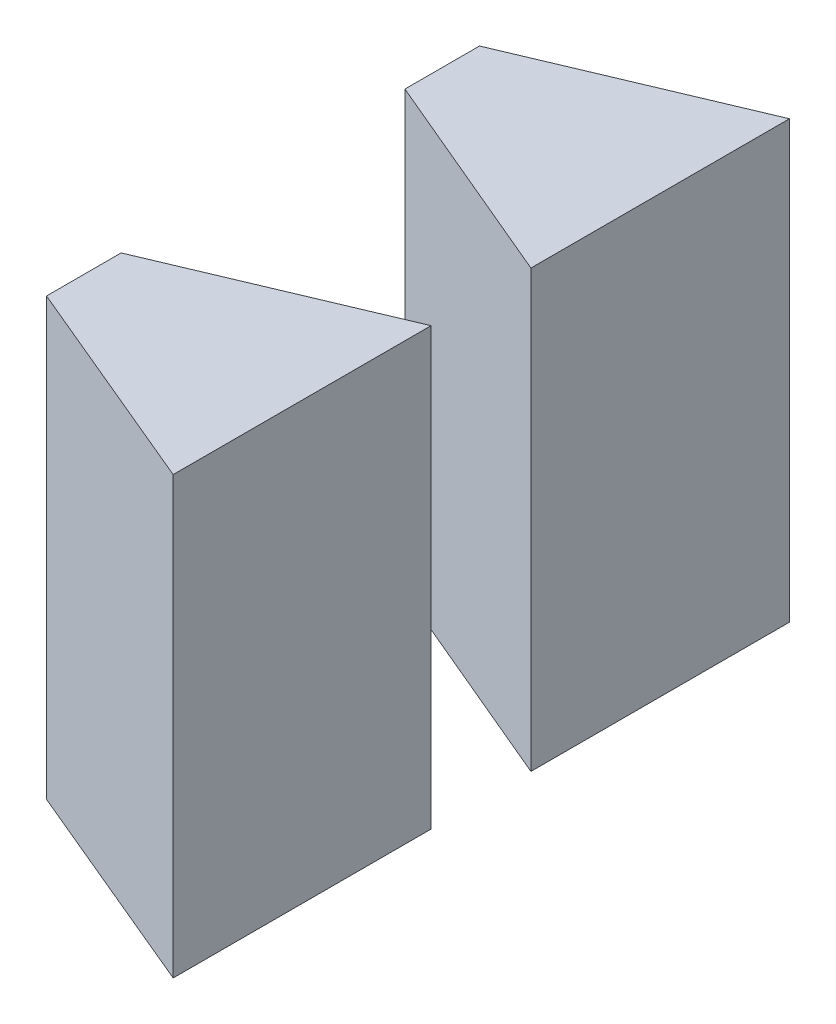
ISO-10303-21;
HEADER;
FILE_DESCRIPTION(('STEP AP214'),'2;1');
FILE_NAME('part.step','',(''),(''),'','','');
FILE_SCHEMA(('AUTOMOTIVE_DESIGN { 1 0 10303 214 1 1 1 1 }'));
ENDSEC;
DATA;
#1=APPLICATION_CONTEXT('core data for automotive mechanical design processes');
#2=APPLICATION_PROTOCOL_DEFINITION('international standard','automotive_design',2000,#1);
#3=PRODUCT_CONTEXT('',#1,'mechanical');
#4=PRODUCT('Part','Part','',(#3));
#5=PRODUCT_RELATED_PRODUCT_CATEGORY('part','',(#4));
#6=PRODUCT_DEFINITION_FORMATION('','',#4);
#7=PRODUCT_DEFINITION_CONTEXT('part definition',#1,'design');
#8=PRODUCT_DEFINITION('design','',#6,#7);
#9=PRODUCT_DEFINITION_SHAPE('','',#8);
#10=(LENGTH_UNIT() NAMED_UNIT(*) SI_UNIT(.MILLI.,.METRE.));
#11=(NAMED_UNIT(*) PLANE_ANGLE_UNIT() SI_UNIT($,.RADIAN.));
#12=(NAMED_UNIT(*) SI_UNIT($,.STERADIAN.) SOLID_ANGLE_UNIT());
#13=UNCERTAINTY_MEASURE_WITH_UNIT(LENGTH_MEASURE(1.E-05),#10,'distance_accuracy_value','');
#14=(GEOMETRIC_REPRESENTATION_CONTEXT(3) GLOBAL_UNCERTAINTY_ASSIGNED_CONTEXT((#13)) GLOBAL_UNIT_ASSIGNED_CONTEXT((#10,
#11,#12)) REPRESENTATION_CONTEXT('',''));
#15=CARTESIAN_POINT('',(0.,0.,0.));
#16=DIRECTION('',(0.,0.,1.));
#17=DIRECTION('',(1.,0.,0.));
#18=AXIS2_PLACEMENT_3D('',#15,#16,#17);
#19=CARTESIAN_POINT('',(0.,25.,0.));
#20=DIRECTION('',(0.,-1.,0.));
#21=DIRECTION('',(0.,0.,-1.));
#22=AXIS2_PLACEMENT_3D('',#19,#20,#21);
#23=PLANE('',#22);
#24=DIRECTION('',(-0.922297893226578,0.,-0.386479748693014));
#25=VECTOR('',#24,1.);
#26=CARTESIAN_POINT('',(2.27480685827349,25.,-5.42861451338171));
#27=LINE('',#26,#25);
#28=CARTESIAN_POINT('',(7.5,25.,-3.23904935540209));
#29=VERTEX_POINT('',#28);
#30=CARTESIAN_POINT('',(0.,25.,-6.38184967673549));
#31=VERTEX_POINT('',#30);
#32=EDGE_CURVE('E113',#29,#31,#27,.T.);
#33=ORIENTED_EDGE('',*,*,#32,.F.);
#34=DIRECTION('',(0.,0.,-1.));
#35=VECTOR('',#34,1.);
#36=CARTESIAN_POINT('',(7.5,25.,0.));
#37=LINE('',#36,#35);
#38=CARTESIAN_POINT('',(7.5,25.,-12.1129208439301));
#39=VERTEX_POINT('',#38);
#40=EDGE_CURVE('E107',#29,#39,#37,.T.);
#41=ORIENTED_EDGE('',*,*,#40,.T.);
#42=DIRECTION('',(-0.921322911056656,0.,0.388798268465909));
#43=VECTOR('',#42,1.);
#44=CARTESIAN_POINT('',(-3.20522356312328,25.,-7.59531650029212));
#45=LINE('',#44,#43);
#46=CARTESIAN_POINT('',(0.,25.,-8.94792084393015));
#47=VERTEX_POINT('',#46);
#48=EDGE_CURVE('E148',#39,#47,#45,.T.);
#49=ORIENTED_EDGE('',*,*,#48,.T.);
#50=DIRECTION('',(0.,0.,1.));
#51=VECTOR('',#50,1.);
#52=CARTESIAN_POINT('',(0.,25.,0.));
#53=LINE('',#52,#51);
#54=EDGE_CURVE('E164',#47,#31,#53,.T.);
#55=ORIENTED_EDGE('',*,*,#54,.T.);
#56=EDGE_LOOP('',(#33,#41,#49,#55));
#57=FACE_BOUND('',#56,.T.);
#58=ADVANCED_FACE('F103',(#57),#23,.F.);
#59=CARTESIAN_POINT('',(0.,10.,0.));
#60=DIRECTION('',(0.,-1.,0.));
#61=DIRECTION('',(0.,0.,-1.));
#62=AXIS2_PLACEMENT_3D('',#59,#60,#61);
#63=PLANE('',#62);
#64=DIRECTION('',(0.,0.,1.));
#65=VECTOR('',#64,1.);
#66=CARTESIAN_POINT('',(7.5,10.,0.));
#67=LINE('',#66,#65);
#68=CARTESIAN_POINT('',(7.5,10.,-12.1129208439301));
#69=VERTEX_POINT('',#68);
#70=CARTESIAN_POINT('',(7.5,10.,-3.23904935540209));
#71=VERTEX_POINT('',#70);
#72=EDGE_CURVE('E158',#69,#71,#67,.T.);
#73=ORIENTED_EDGE('',*,*,#72,.T.);
#74=DIRECTION('',(-0.922297893226578,0.,-0.386479748693014));
#75=VECTOR('',#74,1.);
#76=CARTESIAN_POINT('',(2.27480685827349,10.,-5.42861451338171));
#77=LINE('',#76,#75);
#78=CARTESIAN_POINT('',(0.,10.,-6.38184967673549));
#79=VERTEX_POINT('',#78);
#80=EDGE_CURVE('E121',#71,#79,#77,.T.);
#81=ORIENTED_EDGE('',*,*,#80,.T.);
#82=DIRECTION('',(0.,0.,-1.));
#83=VECTOR('',#82,1.);
#84=CARTESIAN_POINT('',(0.,10.,0.));
#85=LINE('',#84,#83);
#86=CARTESIAN_POINT('',(0.,10.,-8.94792084393015));
#87=VERTEX_POINT('',#86);
#88=EDGE_CURVE('E160',#79,#87,#85,.T.);
#89=ORIENTED_EDGE('',*,*,#88,.T.);
#90=DIRECTION('',(-0.921322911056656,0.,0.388798268465909));
#91=VECTOR('',#90,1.);
#92=CARTESIAN_POINT('',(-3.20522356312328,10.,-7.59531650029212));
#93=LINE('',#92,#91);
#94=EDGE_CURVE('E145',#69,#87,#93,.T.);
#95=ORIENTED_EDGE('',*,*,#94,.F.);
#96=EDGE_LOOP('',(#73,#81,#89,#95));
#97=FACE_BOUND('',#96,.T.);
#98=ADVANCED_FACE('F157',(#97),#63,.T.);
#99=CARTESIAN_POINT('',(7.5,25.,0.));
#100=DIRECTION('',(-1.,0.,0.));
#101=DIRECTION('',(0.,0.,1.));
#102=AXIS2_PLACEMENT_3D('',#99,#100,#101);
#103=PLANE('',#102);
#104=DIRECTION('',(0.,-1.,0.));
#105=VECTOR('',#104,1.);
#106=CARTESIAN_POINT('',(7.5,25.,-3.23904935540209));
#107=LINE('',#106,#105);
#108=EDGE_CURVE('E137',#29,#71,#107,.T.);
#109=ORIENTED_EDGE('',*,*,#108,.T.);
#110=ORIENTED_EDGE('',*,*,#72,.F.);
#111=DIRECTION('',(0.,-1.,0.));
#112=VECTOR('',#111,1.);
#113=CARTESIAN_POINT('',(7.5,25.,-12.1129208439301));
#114=LINE('',#113,#112);
#115=EDGE_CURVE('E142',#39,#69,#114,.T.);
#116=ORIENTED_EDGE('',*,*,#115,.F.);
#117=ORIENTED_EDGE('',*,*,#40,.F.);
#118=EDGE_LOOP('',(#109,#110,#116,#117));
#119=FACE_BOUND('',#118,.T.);
#120=ADVANCED_FACE('F163',(#119),#103,.F.);
#121=CARTESIAN_POINT('',(0.,25.,0.));
#122=DIRECTION('',(1.,0.,0.));
#123=DIRECTION('',(0.,0.,-1.));
#124=AXIS2_PLACEMENT_3D('',#121,#122,#123);
#125=PLANE('',#124);
#126=DIRECTION('',(0.,-1.,0.));
#127=VECTOR('',#126,1.);
#128=CARTESIAN_POINT('',(0.,25.,-6.38184967673549));
#129=LINE('',#128,#127);
#130=EDGE_CURVE('E13',#31,#79,#129,.T.);
#131=ORIENTED_EDGE('',*,*,#130,.F.);
#132=ORIENTED_EDGE('',*,*,#54,.F.);
#133=DIRECTION('',(0.,-1.,0.));
#134=VECTOR('',#133,1.);
#135=CARTESIAN_POINT('',(0.,25.,-8.94792084393015));
#136=LINE('',#135,#134);
#137=EDGE_CURVE('E161',#47,#87,#136,.T.);
#138=ORIENTED_EDGE('',*,*,#137,.T.);
#139=ORIENTED_EDGE('',*,*,#88,.F.);
#140=EDGE_LOOP('',(#131,#132,#138,#139));
#141=FACE_BOUND('',#140,.T.);
#142=ADVANCED_FACE('F105',(#141),#125,.F.);
#143=CARTESIAN_POINT('',(-3.20522356312328,25.,-7.59531650029212));
#144=DIRECTION('',(0.388798268465909,0.,0.921322911056656));
#145=DIRECTION('',(0.921322911056656,0.,-0.388798268465909));
#146=AXIS2_PLACEMENT_3D('',#143,#144,#145);
#147=PLANE('',#146);
#148=ORIENTED_EDGE('',*,*,#94,.T.);
#149=ORIENTED_EDGE('',*,*,#137,.F.);
#150=ORIENTED_EDGE('',*,*,#48,.F.);
#151=ORIENTED_EDGE('',*,*,#115,.T.);
#152=EDGE_LOOP('',(#148,#149,#150,#151));
#153=FACE_BOUND('',#152,.T.);
#154=ADVANCED_FACE('F144',(#153),#147,.F.);
#155=CARTESIAN_POINT('',(2.27480685827349,25.,-5.42861451338171));
#156=DIRECTION('',(-0.386479748693014,0.,0.922297893226578));
#157=DIRECTION('',(0.922297893226578,0.,0.386479748693014));
#158=AXIS2_PLACEMENT_3D('',#155,#156,#157);
#159=PLANE('',#158);
#160=ORIENTED_EDGE('',*,*,#108,.F.);
#161=ORIENTED_EDGE('',*,*,#32,.T.);
#162=ORIENTED_EDGE('',*,*,#130,.T.);
#163=ORIENTED_EDGE('',*,*,#80,.F.);
#164=EDGE_LOOP('',(#160,#161,#162,#163));
#165=FACE_BOUND('',#164,.T.);
#166=ADVANCED_FACE('F176',(#165),#159,.T.);
#167=CLOSED_SHELL('',(#58,#98,#120,#142,#154,#166));
#168=MANIFOLD_SOLID_BREP('B2',#167);
#169=CARTESIAN_POINT('',(0.,25.,0.));
#170=DIRECTION('',(0.,-1.,0.));
#171=DIRECTION('',(0.,0.,-1.));
#172=AXIS2_PLACEMENT_3D('',#169,#170,#171);
#173=PLANE('',#172);
#174=DIRECTION('',(-0.921322911056656,0.,-0.388798268465909));
#175=VECTOR('',#174,1.);
#176=CARTESIAN_POINT('',(7.5,25.,-15.5470791560699));
#177=LINE('',#176,#175);
#178=CARTESIAN_POINT('',(7.5,25.,-15.5470791560699));
#179=VERTEX_POINT('',#178);
#180=CARTESIAN_POINT('',(0.,25.,-18.7120791560699));
#181=VERTEX_POINT('',#180);
#182=EDGE_CURVE('E266',#179,#181,#177,.T.);
#183=ORIENTED_EDGE('',*,*,#182,.F.);
#184=DIRECTION('',(0.,0.,-1.));
#185=VECTOR('',#184,1.);
#186=CARTESIAN_POINT('',(7.5,25.,0.));
#187=LINE('',#186,#185);
#188=CARTESIAN_POINT('',(7.5,25.,-24.4429208439301));
#189=VERTEX_POINT('',#188);
#190=EDGE_CURVE('E289',#179,#189,#187,.T.);
#191=ORIENTED_EDGE('',*,*,#190,.T.);
#192=DIRECTION('',(-0.921322911056656,0.,0.388798268465909));
#193=VECTOR('',#192,1.);
#194=CARTESIAN_POINT('',(-7.62193748165541,25.,-18.0614632266716));
#195=LINE('',#194,#193);
#196=CARTESIAN_POINT('',(0.,25.,-21.2779208439301));
#197=VERTEX_POINT('',#196);
#198=EDGE_CURVE('E287',#189,#197,#195,.T.);
#199=ORIENTED_EDGE('',*,*,#198,.T.);
#200=DIRECTION('',(0.,0.,1.));
#201=VECTOR('',#200,1.);
#202=CARTESIAN_POINT('',(0.,25.,0.));
#203=LINE('',#202,#201);
#204=EDGE_CURVE('E281',#197,#181,#203,.T.);
#205=ORIENTED_EDGE('',*,*,#204,.T.);
#206=EDGE_LOOP('',(#183,#191,#199,#205));
#207=FACE_BOUND('',#206,.T.);
#208=ADVANCED_FACE('F227',(#207),#173,.F.);
#209=CARTESIAN_POINT('',(0.,10.,0.));
#210=DIRECTION('',(0.,-1.,0.));
#211=DIRECTION('',(0.,0.,-1.));
#212=AXIS2_PLACEMENT_3D('',#209,#210,#211);
#213=PLANE('',#212);
#214=DIRECTION('',(0.,0.,1.));
#215=VECTOR('',#214,1.);
#216=CARTESIAN_POINT('',(7.5,10.,0.));
#217=LINE('',#216,#215);
#218=CARTESIAN_POINT('',(7.5,10.,-24.4429208439301));
#219=VERTEX_POINT('',#218);
#220=CARTESIAN_POINT('',(7.5,10.,-15.5470791560699));
#221=VERTEX_POINT('',#220);
#222=EDGE_CURVE('E290',#219,#221,#217,.T.);
#223=ORIENTED_EDGE('',*,*,#222,.T.);
#224=DIRECTION('',(-0.921322911056656,0.,-0.388798268465909));
#225=VECTOR('',#224,1.);
#226=CARTESIAN_POINT('',(6.70283053149137,10.,-15.8834846717805));
#227=LINE('',#226,#225);
#228=CARTESIAN_POINT('',(0.,10.,-18.7120791560699));
#229=VERTEX_POINT('',#228);
#230=EDGE_CURVE('E101',#221,#229,#227,.T.);
#231=ORIENTED_EDGE('',*,*,#230,.T.);
#232=DIRECTION('',(0.,0.,-1.));
#233=VECTOR('',#232,1.);
#234=CARTESIAN_POINT('',(0.,10.,0.));
#235=LINE('',#234,#233);
#236=CARTESIAN_POINT('',(0.,10.,-21.2779208439301));
#237=VERTEX_POINT('',#236);
#238=EDGE_CURVE('E283',#229,#237,#235,.T.);
#239=ORIENTED_EDGE('',*,*,#238,.T.);
#240=DIRECTION('',(-0.921322911056656,0.,0.388798268465909));
#241=VECTOR('',#240,1.);
#242=CARTESIAN_POINT('',(-7.62193748165541,10.,-18.0614632266716));
#243=LINE('',#242,#241);
#244=EDGE_CURVE('E236',#219,#237,#243,.T.);
#245=ORIENTED_EDGE('',*,*,#244,.F.);
#246=EDGE_LOOP('',(#223,#231,#239,#245));
#247=FACE_BOUND('',#246,.T.);
#248=ADVANCED_FACE('F304',(#247),#213,.T.);
#249=CARTESIAN_POINT('',(7.5,25.,0.));
#250=DIRECTION('',(-1.,0.,0.));
#251=DIRECTION('',(0.,0.,1.));
#252=AXIS2_PLACEMENT_3D('',#249,#250,#251);
#253=PLANE('',#252);
#254=DIRECTION('',(0.,-1.,0.));
#255=VECTOR('',#254,1.);
#256=CARTESIAN_POINT('',(7.5,25.,-15.5470791560699));
#257=LINE('',#256,#255);
#258=EDGE_CURVE('E269',#179,#221,#257,.T.);
#259=ORIENTED_EDGE('',*,*,#258,.T.);
#260=ORIENTED_EDGE('',*,*,#222,.F.);
#261=DIRECTION('',(0.,-1.,0.));
#262=VECTOR('',#261,1.);
#263=CARTESIAN_POINT('',(7.5,25.,-24.4429208439301));
#264=LINE('',#263,#262);
#265=EDGE_CURVE('E243',#189,#219,#264,.T.);
#266=ORIENTED_EDGE('',*,*,#265,.F.);
#267=ORIENTED_EDGE('',*,*,#190,.F.);
#268=EDGE_LOOP('',(#259,#260,#266,#267));
#269=FACE_BOUND('',#268,.T.);
#270=ADVANCED_FACE('F313',(#269),#253,.F.);
#271=CARTESIAN_POINT('',(0.,25.,0.));
#272=DIRECTION('',(1.,0.,0.));
#273=DIRECTION('',(0.,0.,-1.));
#274=AXIS2_PLACEMENT_3D('',#271,#272,#273);
#275=PLANE('',#274);
#276=DIRECTION('',(0.,-1.,0.));
#277=VECTOR('',#276,1.);
#278=CARTESIAN_POINT('',(0.,25.,-18.7120791560699));
#279=LINE('',#278,#277);
#280=EDGE_CURVE('E251',#181,#229,#279,.T.);
#281=ORIENTED_EDGE('',*,*,#280,.F.);
#282=ORIENTED_EDGE('',*,*,#204,.F.);
#283=DIRECTION('',(0.,-1.,0.));
#284=VECTOR('',#283,1.);
#285=CARTESIAN_POINT('',(0.,25.,-21.2779208439301));
#286=LINE('',#285,#284);
#287=EDGE_CURVE('E275',#197,#237,#286,.T.);
#288=ORIENTED_EDGE('',*,*,#287,.T.);
#289=ORIENTED_EDGE('',*,*,#238,.F.);
#290=EDGE_LOOP('',(#281,#282,#288,#289));
#291=FACE_BOUND('',#290,.T.);
#292=ADVANCED_FACE('F229',(#291),#275,.F.);
#293=CARTESIAN_POINT('',(-7.62193748165541,25.,-18.0614632266716));
#294=DIRECTION('',(0.388798268465909,0.,0.921322911056656));
#295=DIRECTION('',(0.921322911056656,0.,-0.388798268465909));
#296=AXIS2_PLACEMENT_3D('',#293,#294,#295);
#297=PLANE('',#296);
#298=ORIENTED_EDGE('',*,*,#244,.T.);
#299=ORIENTED_EDGE('',*,*,#287,.F.);
#300=ORIENTED_EDGE('',*,*,#198,.F.);
#301=ORIENTED_EDGE('',*,*,#265,.T.);
#302=EDGE_LOOP('',(#298,#299,#300,#301));
#303=FACE_BOUND('',#302,.T.);
#304=ADVANCED_FACE('F299',(#303),#297,.F.);
#305=CARTESIAN_POINT('',(7.5,25.,-15.5470791560699));
#306=DIRECTION('',(-0.388798268465909,0.,0.921322911056656));
#307=DIRECTION('',(0.921322911056656,0.,0.388798268465909));
#308=AXIS2_PLACEMENT_3D('',#305,#306,#307);
#309=PLANE('',#308);
#310=ORIENTED_EDGE('',*,*,#258,.F.);
#311=ORIENTED_EDGE('',*,*,#182,.T.);
#312=ORIENTED_EDGE('',*,*,#280,.T.);
#313=ORIENTED_EDGE('',*,*,#230,.F.);
#314=EDGE_LOOP('',(#310,#311,#312,#313));
#315=FACE_BOUND('',#314,.T.);
#316=ADVANCED_FACE('F267',(#315),#309,.T.);
#317=CLOSED_SHELL('',(#208,#248,#270,#292,#304,#316));
#318=MANIFOLD_SOLID_BREP('B7',#317);
#319=ADVANCED_BREP_SHAPE_REPRESENTATION('',(#18,#168,#318),#14);
#320=SHAPE_DEFINITION_REPRESENTATION(#9,#319);
ENDSEC;
END-ISO-10303-21;
